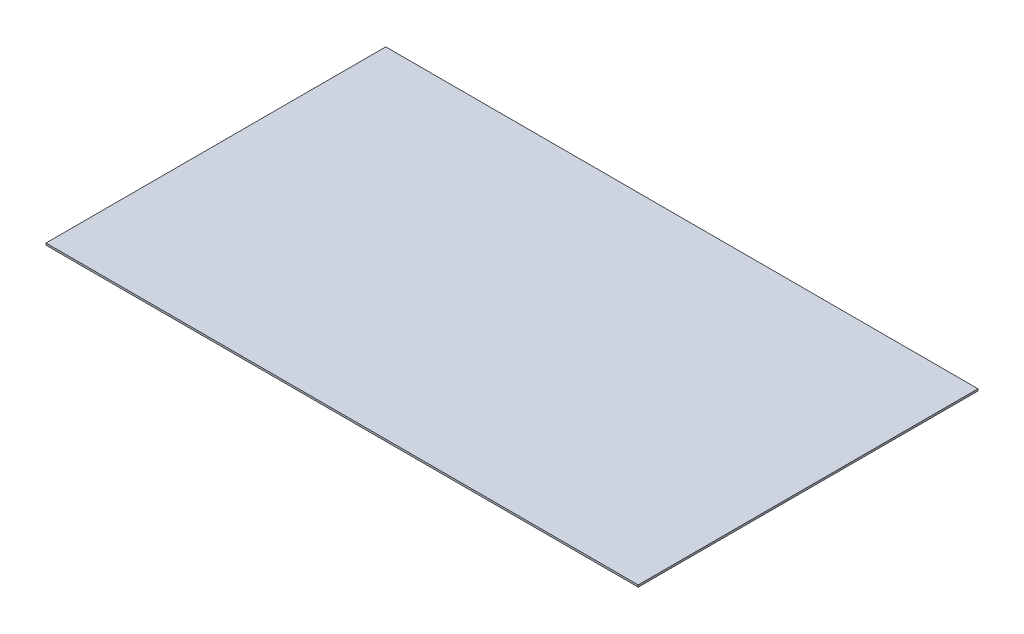
ISO-10303-21;
HEADER;
FILE_DESCRIPTION(('STEP AP214'),'2;1');
FILE_NAME('part.step','',(''),(''),'','','');
FILE_SCHEMA(('AUTOMOTIVE_DESIGN { 1 0 10303 214 1 1 1 1 }'));
ENDSEC;
DATA;
#1=APPLICATION_CONTEXT('core data for automotive mechanical design processes');
#2=APPLICATION_PROTOCOL_DEFINITION('international standard','automotive_design',2000,#1);
#3=PRODUCT_CONTEXT('',#1,'mechanical');
#4=PRODUCT('Part','Part','',(#3));
#5=PRODUCT_RELATED_PRODUCT_CATEGORY('part','',(#4));
#6=PRODUCT_DEFINITION_FORMATION('','',#4);
#7=PRODUCT_DEFINITION_CONTEXT('part definition',#1,'design');
#8=PRODUCT_DEFINITION('design','',#6,#7);
#9=PRODUCT_DEFINITION_SHAPE('','',#8);
#10=(LENGTH_UNIT() NAMED_UNIT(*) SI_UNIT(.MILLI.,.METRE.));
#11=(NAMED_UNIT(*) PLANE_ANGLE_UNIT() SI_UNIT($,.RADIAN.));
#12=(NAMED_UNIT(*) SI_UNIT($,.STERADIAN.) SOLID_ANGLE_UNIT());
#13=UNCERTAINTY_MEASURE_WITH_UNIT(LENGTH_MEASURE(1.E-05),#10,'distance_accuracy_value','');
#14=(GEOMETRIC_REPRESENTATION_CONTEXT(3) GLOBAL_UNCERTAINTY_ASSIGNED_CONTEXT((#13)) GLOBAL_UNIT_ASSIGNED_CONTEXT((#10,
#11,#12)) REPRESENTATION_CONTEXT('',''));
#15=CARTESIAN_POINT('',(0.,0.,0.));
#16=DIRECTION('',(0.,0.,1.));
#17=DIRECTION('',(1.,0.,0.));
#18=AXIS2_PLACEMENT_3D('',#15,#16,#17);
#19=CARTESIAN_POINT('',(-34.8624999999999,0.112500000000161,-20.));
#20=DIRECTION('',(1.,0.,0.));
#21=DIRECTION('',(0.,0.,-1.));
#22=AXIS2_PLACEMENT_3D('',#19,#20,#21);
#23=PLANE('',#22);
#24=DIRECTION('',(0.,0.,1.));
#25=VECTOR('',#24,1.);
#26=CARTESIAN_POINT('',(-34.8624999999999,-0.112499999999842,-20.));
#27=LINE('',#26,#25);
#28=CARTESIAN_POINT('',(-34.8624999999999,-0.112499999999842,-20.));
#29=VERTEX_POINT('',#28);
#30=CARTESIAN_POINT('',(-34.8624999999999,-0.112500000000203,20.));
#31=VERTEX_POINT('',#30);
#32=EDGE_CURVE('E95',#29,#31,#27,.T.);
#33=ORIENTED_EDGE('',*,*,#32,.T.);
#34=DIRECTION('',(0.,-1.,0.));
#35=VECTOR('',#34,1.);
#36=CARTESIAN_POINT('',(-34.8624999999999,0.1124999999998,20.));
#37=LINE('',#36,#35);
#38=CARTESIAN_POINT('',(-34.8624999999999,0.1124999999998,20.));
#39=VERTEX_POINT('',#38);
#40=EDGE_CURVE('E11',#39,#31,#37,.T.);
#41=ORIENTED_EDGE('',*,*,#40,.F.);
#42=DIRECTION('',(0.,0.,1.));
#43=VECTOR('',#42,1.);
#44=CARTESIAN_POINT('',(-34.8624999999999,0.112500000000161,-20.));
#45=LINE('',#44,#43);
#46=CARTESIAN_POINT('',(-34.8624999999999,0.112500000000161,-20.));
#47=VERTEX_POINT('',#46);
#48=EDGE_CURVE('E83',#47,#39,#45,.T.);
#49=ORIENTED_EDGE('',*,*,#48,.F.);
#50=DIRECTION('',(0.,-1.,0.));
#51=VECTOR('',#50,1.);
#52=CARTESIAN_POINT('',(-34.8624999999999,0.112500000000161,-20.));
#53=LINE('',#52,#51);
#54=EDGE_CURVE('E91',#47,#29,#53,.T.);
#55=ORIENTED_EDGE('',*,*,#54,.T.);
#56=EDGE_LOOP('',(#33,#41,#49,#55));
#57=FACE_BOUND('',#56,.T.);
#58=ADVANCED_FACE('F32',(#57),#23,.F.);
#59=CARTESIAN_POINT('',(34.8625000000001,0.112499999999821,20.));
#60=DIRECTION('',(0.,0.,-1.));
#61=DIRECTION('',(-1.,0.,0.));
#62=AXIS2_PLACEMENT_3D('',#59,#60,#61);
#63=PLANE('',#62);
#64=DIRECTION('',(1.,0.,0.));
#65=VECTOR('',#64,1.);
#66=CARTESIAN_POINT('',(34.8625000000001,-0.112500000000182,20.));
#67=LINE('',#66,#65);
#68=CARTESIAN_POINT('',(34.8625000000001,-0.112500000000182,20.));
#69=VERTEX_POINT('',#68);
#70=EDGE_CURVE('E87',#31,#69,#67,.T.);
#71=ORIENTED_EDGE('',*,*,#70,.T.);
#72=DIRECTION('',(0.,-1.,0.));
#73=VECTOR('',#72,1.);
#74=CARTESIAN_POINT('',(34.8625000000001,0.112499999999821,20.));
#75=LINE('',#74,#73);
#76=CARTESIAN_POINT('',(34.8625000000001,0.112499999999821,20.));
#77=VERTEX_POINT('',#76);
#78=EDGE_CURVE('E40',#77,#69,#75,.T.);
#79=ORIENTED_EDGE('',*,*,#78,.F.);
#80=DIRECTION('',(1.,0.,0.));
#81=VECTOR('',#80,1.);
#82=CARTESIAN_POINT('',(34.8625000000001,0.112499999999821,20.));
#83=LINE('',#82,#81);
#84=EDGE_CURVE('E78',#39,#77,#83,.T.);
#85=ORIENTED_EDGE('',*,*,#84,.F.);
#86=ORIENTED_EDGE('',*,*,#40,.T.);
#87=EDGE_LOOP('',(#71,#79,#85,#86));
#88=FACE_BOUND('',#87,.T.);
#89=ADVANCED_FACE('F86',(#88),#63,.F.);
#90=CARTESIAN_POINT('',(34.8625,0.112500000000182,-20.));
#91=DIRECTION('',(-1.,0.,0.));
#92=DIRECTION('',(0.,0.,1.));
#93=AXIS2_PLACEMENT_3D('',#90,#91,#92);
#94=PLANE('',#93);
#95=DIRECTION('',(0.,0.,-1.));
#96=VECTOR('',#95,1.);
#97=CARTESIAN_POINT('',(34.8625,-0.112499999999821,-20.));
#98=LINE('',#97,#96);
#99=CARTESIAN_POINT('',(34.8625,-0.112499999999821,-20.));
#100=VERTEX_POINT('',#99);
#101=EDGE_CURVE('E65',#69,#100,#98,.T.);
#102=ORIENTED_EDGE('',*,*,#101,.T.);
#103=DIRECTION('',(0.,-1.,0.));
#104=VECTOR('',#103,1.);
#105=CARTESIAN_POINT('',(34.8625,0.112500000000182,-20.));
#106=LINE('',#105,#104);
#107=CARTESIAN_POINT('',(34.8625,0.112500000000182,-20.));
#108=VERTEX_POINT('',#107);
#109=EDGE_CURVE('E88',#108,#100,#106,.T.);
#110=ORIENTED_EDGE('',*,*,#109,.F.);
#111=DIRECTION('',(0.,0.,-1.));
#112=VECTOR('',#111,1.);
#113=CARTESIAN_POINT('',(34.8625,0.112500000000182,-20.));
#114=LINE('',#113,#112);
#115=EDGE_CURVE('E81',#77,#108,#114,.T.);
#116=ORIENTED_EDGE('',*,*,#115,.F.);
#117=ORIENTED_EDGE('',*,*,#78,.T.);
#118=EDGE_LOOP('',(#102,#110,#116,#117));
#119=FACE_BOUND('',#118,.T.);
#120=ADVANCED_FACE('F89',(#119),#94,.F.);
#121=CARTESIAN_POINT('',(34.8625,0.112500000000182,-20.));
#122=DIRECTION('',(0.,0.,1.));
#123=DIRECTION('',(1.,0.,0.));
#124=AXIS2_PLACEMENT_3D('',#121,#122,#123);
#125=PLANE('',#124);
#126=DIRECTION('',(-1.,0.,0.));
#127=VECTOR('',#126,1.);
#128=CARTESIAN_POINT('',(34.8625,-0.112499999999821,-20.));
#129=LINE('',#128,#127);
#130=EDGE_CURVE('E71',#100,#29,#129,.T.);
#131=ORIENTED_EDGE('',*,*,#130,.T.);
#132=ORIENTED_EDGE('',*,*,#54,.F.);
#133=DIRECTION('',(-1.,0.,0.));
#134=VECTOR('',#133,1.);
#135=CARTESIAN_POINT('',(34.8625,0.112500000000182,-20.));
#136=LINE('',#135,#134);
#137=EDGE_CURVE('E48',#108,#47,#136,.T.);
#138=ORIENTED_EDGE('',*,*,#137,.F.);
#139=ORIENTED_EDGE('',*,*,#109,.T.);
#140=EDGE_LOOP('',(#131,#132,#138,#139));
#141=FACE_BOUND('',#140,.T.);
#142=ADVANCED_FACE('F102',(#141),#125,.F.);
#143=CARTESIAN_POINT('',(0.,0.112500000000001,0.));
#144=DIRECTION('',(0.,-1.,0.));
#145=DIRECTION('',(0.,0.,-1.));
#146=AXIS2_PLACEMENT_3D('',#143,#144,#145);
#147=PLANE('',#146);
#148=ORIENTED_EDGE('',*,*,#48,.T.);
#149=ORIENTED_EDGE('',*,*,#84,.T.);
#150=ORIENTED_EDGE('',*,*,#115,.T.);
#151=ORIENTED_EDGE('',*,*,#137,.T.);
#152=EDGE_LOOP('',(#148,#149,#150,#151));
#153=FACE_BOUND('',#152,.T.);
#154=ADVANCED_FACE('F79',(#153),#147,.F.);
#155=CARTESIAN_POINT('',(0.,-0.112500000000001,0.));
#156=DIRECTION('',(0.,-1.,0.));
#157=DIRECTION('',(0.,0.,-1.));
#158=AXIS2_PLACEMENT_3D('',#155,#156,#157);
#159=PLANE('',#158);
#160=ORIENTED_EDGE('',*,*,#32,.F.);
#161=ORIENTED_EDGE('',*,*,#130,.F.);
#162=ORIENTED_EDGE('',*,*,#101,.F.);
#163=ORIENTED_EDGE('',*,*,#70,.F.);
#164=EDGE_LOOP('',(#160,#161,#162,#163));
#165=FACE_BOUND('',#164,.T.);
#166=ADVANCED_FACE('F105',(#165),#159,.T.);
#167=CLOSED_SHELL('',(#58,#89,#120,#142,#154,#166));
#168=MANIFOLD_SOLID_BREP('B2',#167);
#169=ADVANCED_BREP_SHAPE_REPRESENTATION('',(#18,#168),#14);
#170=SHAPE_DEFINITION_REPRESENTATION(#9,#169);
ENDSEC;
END-ISO-10303-21;
